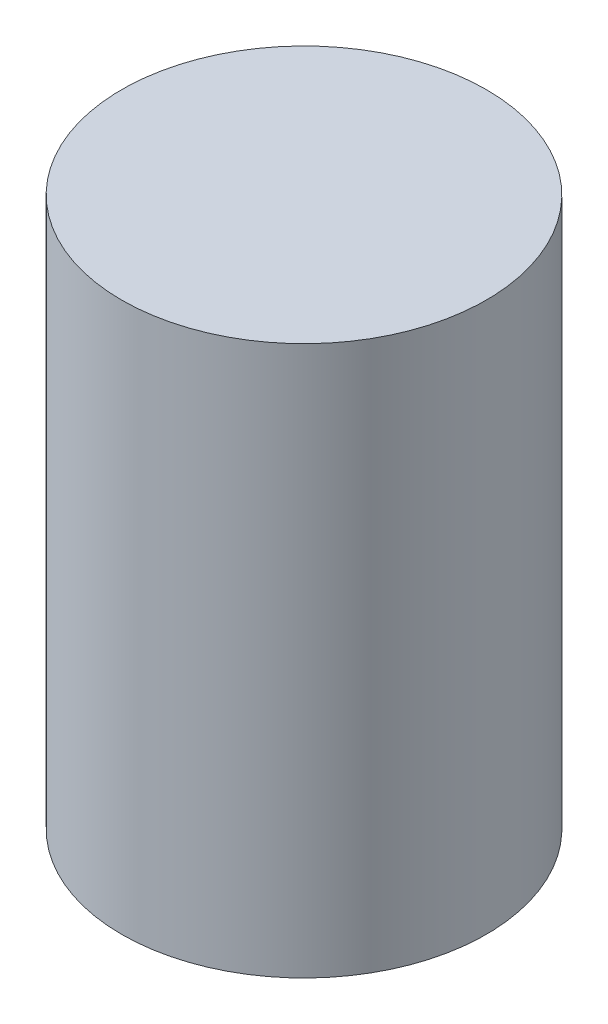
ISO-10303-21;
HEADER;
FILE_DESCRIPTION(('STEP AP214'),'2;1');
FILE_NAME('part.step','',(''),(''),'','','');
FILE_SCHEMA(('AUTOMOTIVE_DESIGN { 1 0 10303 214 1 1 1 1 }'));
ENDSEC;
DATA;
#1=APPLICATION_CONTEXT('core data for automotive mechanical design processes');
#2=APPLICATION_PROTOCOL_DEFINITION('international standard','automotive_design',2000,#1);
#3=PRODUCT_CONTEXT('',#1,'mechanical');
#4=PRODUCT('Part','Part','',(#3));
#5=PRODUCT_RELATED_PRODUCT_CATEGORY('part','',(#4));
#6=PRODUCT_DEFINITION_FORMATION('','',#4);
#7=PRODUCT_DEFINITION_CONTEXT('part definition',#1,'design');
#8=PRODUCT_DEFINITION('design','',#6,#7);
#9=PRODUCT_DEFINITION_SHAPE('','',#8);
#10=(LENGTH_UNIT() NAMED_UNIT(*) SI_UNIT(.MILLI.,.METRE.));
#11=(NAMED_UNIT(*) PLANE_ANGLE_UNIT() SI_UNIT($,.RADIAN.));
#12=(NAMED_UNIT(*) SI_UNIT($,.STERADIAN.) SOLID_ANGLE_UNIT());
#13=UNCERTAINTY_MEASURE_WITH_UNIT(LENGTH_MEASURE(1.E-05),#10,'distance_accuracy_value','');
#14=(GEOMETRIC_REPRESENTATION_CONTEXT(3) GLOBAL_UNCERTAINTY_ASSIGNED_CONTEXT((#13)) GLOBAL_UNIT_ASSIGNED_CONTEXT((#10,
#11,#12)) REPRESENTATION_CONTEXT('',''));
#15=CARTESIAN_POINT('',(0.,0.,0.));
#16=DIRECTION('',(0.,0.,1.));
#17=DIRECTION('',(1.,0.,0.));
#18=AXIS2_PLACEMENT_3D('',#15,#16,#17);
#19=CARTESIAN_POINT('',(0.,9.19,0.));
#20=DIRECTION('',(0.,-1.,0.));
#21=DIRECTION('',(0.,0.,-1.));
#22=AXIS2_PLACEMENT_3D('',#19,#20,#21);
#23=CYLINDRICAL_SURFACE('',#22,3.05);
#24=CARTESIAN_POINT('',(0.,9.19,0.));
#25=DIRECTION('',(0.,1.,0.));
#26=DIRECTION('',(0.,0.,1.));
#27=AXIS2_PLACEMENT_3D('',#24,#25,#26);
#28=CIRCLE('',#27,3.05);
#29=CARTESIAN_POINT('',(0.,9.19,3.05));
#30=VERTEX_POINT('',#29);
#31=EDGE_CURVE('E10',#30,#30,#28,.T.);
#32=ORIENTED_EDGE('',*,*,#31,.F.);
#33=EDGE_LOOP('',(#32));
#34=FACE_BOUND('',#33,.T.);
#35=CARTESIAN_POINT('',(0.,0.,0.));
#36=DIRECTION('',(0.,1.,0.));
#37=DIRECTION('',(0.,0.,1.));
#38=AXIS2_PLACEMENT_3D('',#35,#36,#37);
#39=CIRCLE('',#38,3.05);
#40=CARTESIAN_POINT('',(0.,0.,3.05));
#41=VERTEX_POINT('',#40);
#42=EDGE_CURVE('E34',#41,#41,#39,.T.);
#43=ORIENTED_EDGE('',*,*,#42,.T.);
#44=EDGE_LOOP('',(#43));
#45=FACE_BOUND('',#44,.T.);
#46=ADVANCED_FACE('F31',(#34,#45),#23,.T.);
#47=CARTESIAN_POINT('',(0.,9.19,0.));
#48=DIRECTION('',(0.,1.,0.));
#49=DIRECTION('',(0.,0.,1.));
#50=AXIS2_PLACEMENT_3D('',#47,#48,#49);
#51=PLANE('',#50);
#52=ORIENTED_EDGE('',*,*,#31,.T.);
#53=EDGE_LOOP('',(#52));
#54=FACE_BOUND('',#53,.T.);
#55=ADVANCED_FACE('F46',(#54),#51,.T.);
#56=CARTESIAN_POINT('',(0.,0.,0.));
#57=DIRECTION('',(0.,1.,0.));
#58=DIRECTION('',(0.,0.,1.));
#59=AXIS2_PLACEMENT_3D('',#56,#57,#58);
#60=PLANE('',#59);
#61=ORIENTED_EDGE('',*,*,#42,.F.);
#62=EDGE_LOOP('',(#61));
#63=FACE_BOUND('',#62,.T.);
#64=ADVANCED_FACE('F44',(#63),#60,.F.);
#65=CLOSED_SHELL('',(#46,#55,#64));
#66=MANIFOLD_SOLID_BREP('B2',#65);
#67=ADVANCED_BREP_SHAPE_REPRESENTATION('',(#18,#66),#14);
#68=SHAPE_DEFINITION_REPRESENTATION(#9,#67);
ENDSEC;
END-ISO-10303-21;
